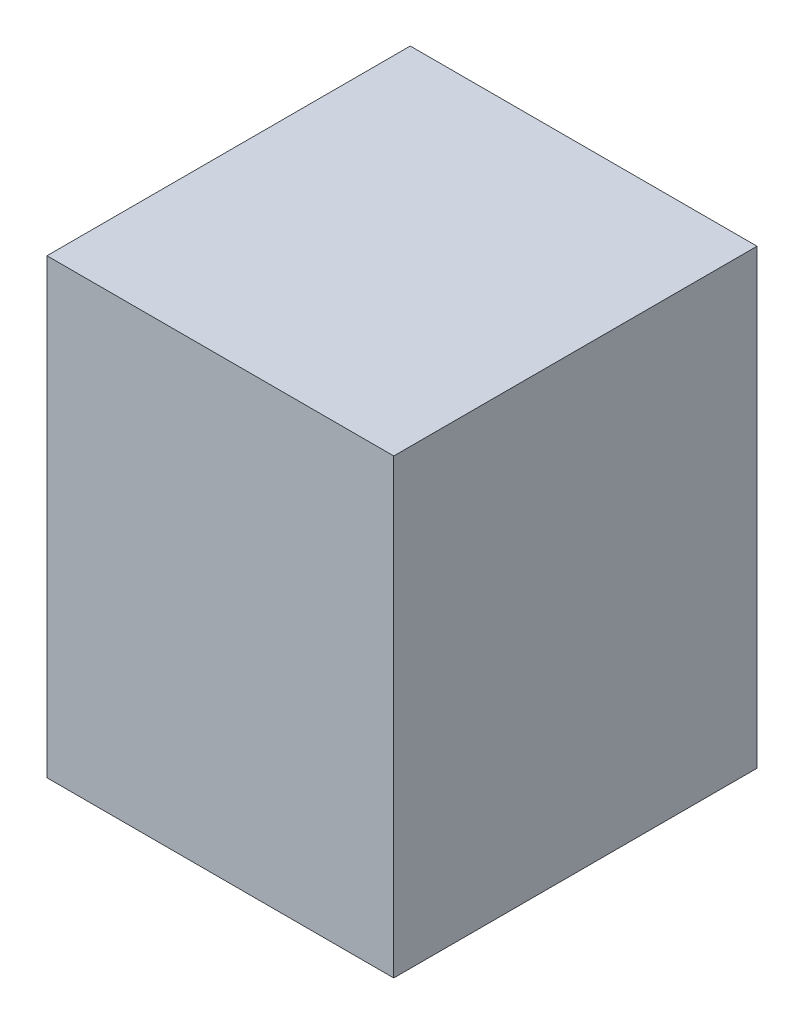
ISO-10303-21;
HEADER;
FILE_DESCRIPTION(('STEP AP214'),'2;1');
FILE_NAME('part.step','',(''),(''),'','','');
FILE_SCHEMA(('AUTOMOTIVE_DESIGN { 1 0 10303 214 1 1 1 1 }'));
ENDSEC;
DATA;
#1=APPLICATION_CONTEXT('core data for automotive mechanical design processes');
#2=APPLICATION_PROTOCOL_DEFINITION('international standard','automotive_design',2000,#1);
#3=PRODUCT_CONTEXT('',#1,'mechanical');
#4=PRODUCT('Part','Part','',(#3));
#5=PRODUCT_RELATED_PRODUCT_CATEGORY('part','',(#4));
#6=PRODUCT_DEFINITION_FORMATION('','',#4);
#7=PRODUCT_DEFINITION_CONTEXT('part definition',#1,'design');
#8=PRODUCT_DEFINITION('design','',#6,#7);
#9=PRODUCT_DEFINITION_SHAPE('','',#8);
#10=(LENGTH_UNIT() NAMED_UNIT(*) SI_UNIT(.MILLI.,.METRE.));
#11=(NAMED_UNIT(*) PLANE_ANGLE_UNIT() SI_UNIT($,.RADIAN.));
#12=(NAMED_UNIT(*) SI_UNIT($,.STERADIAN.) SOLID_ANGLE_UNIT());
#13=UNCERTAINTY_MEASURE_WITH_UNIT(LENGTH_MEASURE(1.E-05),#10,'distance_accuracy_value','');
#14=(GEOMETRIC_REPRESENTATION_CONTEXT(3) GLOBAL_UNCERTAINTY_ASSIGNED_CONTEXT((#13)) GLOBAL_UNIT_ASSIGNED_CONTEXT((#10,
#11,#12)) REPRESENTATION_CONTEXT('',''));
#15=CARTESIAN_POINT('',(0.,0.,0.));
#16=DIRECTION('',(0.,0.,1.));
#17=DIRECTION('',(1.,0.,0.));
#18=AXIS2_PLACEMENT_3D('',#15,#16,#17);
#19=CARTESIAN_POINT('',(0.,0.,0.));
#20=DIRECTION('',(0.,0.,-1.));
#21=DIRECTION('',(-1.,0.,0.));
#22=AXIS2_PLACEMENT_3D('',#19,#20,#21);
#23=PLANE('',#22);
#24=DIRECTION('',(0.,-1.,0.));
#25=VECTOR('',#24,1.);
#26=CARTESIAN_POINT('',(-10.,-10.,0.));
#27=LINE('',#26,#25);
#28=CARTESIAN_POINT('',(-10.,562.45,0.));
#29=VERTEX_POINT('',#28);
#30=CARTESIAN_POINT('',(-10.,-10.,0.));
#31=VERTEX_POINT('',#30);
#32=EDGE_CURVE('E156',#29,#31,#27,.T.);
#33=ORIENTED_EDGE('',*,*,#32,.F.);
#34=DIRECTION('',(-1.,0.,0.));
#35=VECTOR('',#34,1.);
#36=CARTESIAN_POINT('',(-10.,562.45,0.));
#37=LINE('',#36,#35);
#38=CARTESIAN_POINT('',(429.1,562.45,0.));
#39=VERTEX_POINT('',#38);
#40=EDGE_CURVE('E56',#39,#29,#37,.T.);
#41=ORIENTED_EDGE('',*,*,#40,.F.);
#42=DIRECTION('',(0.,1.,0.));
#43=VECTOR('',#42,1.);
#44=CARTESIAN_POINT('',(429.1,-10.,0.));
#45=LINE('',#44,#43);
#46=CARTESIAN_POINT('',(429.1,-10.,0.));
#47=VERTEX_POINT('',#46);
#48=EDGE_CURVE('E107',#47,#39,#45,.T.);
#49=ORIENTED_EDGE('',*,*,#48,.F.);
#50=DIRECTION('',(1.,0.,0.));
#51=VECTOR('',#50,1.);
#52=CARTESIAN_POINT('',(-10.,-10.,0.));
#53=LINE('',#52,#51);
#54=EDGE_CURVE('E159',#31,#47,#53,.T.);
#55=ORIENTED_EDGE('',*,*,#54,.F.);
#56=EDGE_LOOP('',(#33,#41,#49,#55));
#57=FACE_BOUND('',#56,.T.);
#58=DIRECTION('',(1.,0.,0.));
#59=VECTOR('',#58,1.);
#60=CARTESIAN_POINT('',(419.1,0.,0.));
#61=LINE('',#60,#59);
#62=CARTESIAN_POINT('',(0.,0.,0.));
#63=VERTEX_POINT('',#62);
#64=CARTESIAN_POINT('',(419.1,0.,0.));
#65=VERTEX_POINT('',#64);
#66=EDGE_CURVE('E130',#63,#65,#61,.T.);
#67=ORIENTED_EDGE('',*,*,#66,.T.);
#68=DIRECTION('',(0.,1.,0.));
#69=VECTOR('',#68,1.);
#70=CARTESIAN_POINT('',(419.1,552.45,0.));
#71=LINE('',#70,#69);
#72=CARTESIAN_POINT('',(419.1,552.45,0.));
#73=VERTEX_POINT('',#72);
#74=EDGE_CURVE('E48',#65,#73,#71,.T.);
#75=ORIENTED_EDGE('',*,*,#74,.T.);
#76=DIRECTION('',(-1.,0.,0.));
#77=VECTOR('',#76,1.);
#78=CARTESIAN_POINT('',(419.1,552.45,0.));
#79=LINE('',#78,#77);
#80=CARTESIAN_POINT('',(0.,552.45,0.));
#81=VERTEX_POINT('',#80);
#82=EDGE_CURVE('E141',#73,#81,#79,.T.);
#83=ORIENTED_EDGE('',*,*,#82,.T.);
#84=DIRECTION('',(0.,-1.,0.));
#85=VECTOR('',#84,1.);
#86=CARTESIAN_POINT('',(0.,552.45,0.));
#87=LINE('',#86,#85);
#88=EDGE_CURVE('E144',#81,#63,#87,.T.);
#89=ORIENTED_EDGE('',*,*,#88,.T.);
#90=EDGE_LOOP('',(#67,#75,#83,#89));
#91=FACE_BOUND('',#90,.T.);
#92=ADVANCED_FACE('F33',(#57,#91),#23,.T.);
#93=CARTESIAN_POINT('',(-10.,-10.,450.));
#94=DIRECTION('',(1.,0.,0.));
#95=DIRECTION('',(0.,0.,-1.));
#96=AXIS2_PLACEMENT_3D('',#93,#94,#95);
#97=PLANE('',#96);
#98=ORIENTED_EDGE('',*,*,#32,.T.);
#99=DIRECTION('',(0.,0.,-1.));
#100=VECTOR('',#99,1.);
#101=CARTESIAN_POINT('',(-10.,-10.,450.));
#102=LINE('',#101,#100);
#103=CARTESIAN_POINT('',(-10.,-10.,460.));
#104=VERTEX_POINT('',#103);
#105=EDGE_CURVE('E11',#104,#31,#102,.T.);
#106=ORIENTED_EDGE('',*,*,#105,.F.);
#107=DIRECTION('',(0.,-1.,0.));
#108=VECTOR('',#107,1.);
#109=CARTESIAN_POINT('',(-10.,562.45,460.));
#110=LINE('',#109,#108);
#111=CARTESIAN_POINT('',(-10.,562.45,460.));
#112=VERTEX_POINT('',#111);
#113=EDGE_CURVE('E116',#112,#104,#110,.T.);
#114=ORIENTED_EDGE('',*,*,#113,.F.);
#115=DIRECTION('',(0.,0.,-1.));
#116=VECTOR('',#115,1.);
#117=CARTESIAN_POINT('',(-10.,562.45,450.));
#118=LINE('',#117,#116);
#119=EDGE_CURVE('E108',#112,#29,#118,.T.);
#120=ORIENTED_EDGE('',*,*,#119,.T.);
#121=EDGE_LOOP('',(#98,#106,#114,#120));
#122=FACE_BOUND('',#121,.T.);
#123=ADVANCED_FACE('F35',(#122),#97,.F.);
#124=CARTESIAN_POINT('',(-10.,-10.,450.));
#125=DIRECTION('',(0.,1.,0.));
#126=DIRECTION('',(0.,0.,1.));
#127=AXIS2_PLACEMENT_3D('',#124,#125,#126);
#128=PLANE('',#127);
#129=ORIENTED_EDGE('',*,*,#54,.T.);
#130=DIRECTION('',(0.,0.,-1.));
#131=VECTOR('',#130,1.);
#132=CARTESIAN_POINT('',(429.1,-10.,450.));
#133=LINE('',#132,#131);
#134=CARTESIAN_POINT('',(429.1,-10.,460.));
#135=VERTEX_POINT('',#134);
#136=EDGE_CURVE('E41',#135,#47,#133,.T.);
#137=ORIENTED_EDGE('',*,*,#136,.F.);
#138=DIRECTION('',(1.,0.,0.));
#139=VECTOR('',#138,1.);
#140=CARTESIAN_POINT('',(429.1,-10.,460.));
#141=LINE('',#140,#139);
#142=EDGE_CURVE('E121',#104,#135,#141,.T.);
#143=ORIENTED_EDGE('',*,*,#142,.F.);
#144=ORIENTED_EDGE('',*,*,#105,.T.);
#145=EDGE_LOOP('',(#129,#137,#143,#144));
#146=FACE_BOUND('',#145,.T.);
#147=ADVANCED_FACE('F168',(#146),#128,.F.);
#148=CARTESIAN_POINT('',(429.1,-10.,450.));
#149=DIRECTION('',(-1.,0.,0.));
#150=DIRECTION('',(0.,0.,1.));
#151=AXIS2_PLACEMENT_3D('',#148,#149,#150);
#152=PLANE('',#151);
#153=ORIENTED_EDGE('',*,*,#48,.T.);
#154=DIRECTION('',(0.,0.,-1.));
#155=VECTOR('',#154,1.);
#156=CARTESIAN_POINT('',(429.1,562.45,450.));
#157=LINE('',#156,#155);
#158=CARTESIAN_POINT('',(429.1,562.45,460.));
#159=VERTEX_POINT('',#158);
#160=EDGE_CURVE('E100',#159,#39,#157,.T.);
#161=ORIENTED_EDGE('',*,*,#160,.F.);
#162=DIRECTION('',(0.,1.,0.));
#163=VECTOR('',#162,1.);
#164=CARTESIAN_POINT('',(429.1,562.45,460.));
#165=LINE('',#164,#163);
#166=EDGE_CURVE('E105',#135,#159,#165,.T.);
#167=ORIENTED_EDGE('',*,*,#166,.F.);
#168=ORIENTED_EDGE('',*,*,#136,.T.);
#169=EDGE_LOOP('',(#153,#161,#167,#168));
#170=FACE_BOUND('',#169,.T.);
#171=ADVANCED_FACE('F102',(#170),#152,.F.);
#172=CARTESIAN_POINT('',(-10.,562.45,450.));
#173=DIRECTION('',(0.,-1.,0.));
#174=DIRECTION('',(0.,0.,-1.));
#175=AXIS2_PLACEMENT_3D('',#172,#173,#174);
#176=PLANE('',#175);
#177=ORIENTED_EDGE('',*,*,#40,.T.);
#178=ORIENTED_EDGE('',*,*,#119,.F.);
#179=DIRECTION('',(-1.,0.,0.));
#180=VECTOR('',#179,1.);
#181=CARTESIAN_POINT('',(429.1,562.45,460.));
#182=LINE('',#181,#180);
#183=EDGE_CURVE('E111',#159,#112,#182,.T.);
#184=ORIENTED_EDGE('',*,*,#183,.F.);
#185=ORIENTED_EDGE('',*,*,#160,.T.);
#186=EDGE_LOOP('',(#177,#178,#184,#185));
#187=FACE_BOUND('',#186,.T.);
#188=ADVANCED_FACE('F112',(#187),#176,.F.);
#189=CARTESIAN_POINT('',(419.1,552.45,450.));
#190=DIRECTION('',(-1.,0.,0.));
#191=DIRECTION('',(0.,0.,1.));
#192=AXIS2_PLACEMENT_3D('',#189,#190,#191);
#193=PLANE('',#192);
#194=ORIENTED_EDGE('',*,*,#74,.F.);
#195=DIRECTION('',(0.,0.,-1.));
#196=VECTOR('',#195,1.);
#197=CARTESIAN_POINT('',(419.1,0.,450.));
#198=LINE('',#197,#196);
#199=CARTESIAN_POINT('',(419.1,0.,450.));
#200=VERTEX_POINT('',#199);
#201=EDGE_CURVE('E139',#200,#65,#198,.T.);
#202=ORIENTED_EDGE('',*,*,#201,.F.);
#203=DIRECTION('',(0.,1.,0.));
#204=VECTOR('',#203,1.);
#205=CARTESIAN_POINT('',(419.1,552.45,450.));
#206=LINE('',#205,#204);
#207=CARTESIAN_POINT('',(419.1,552.45,450.));
#208=VERTEX_POINT('',#207);
#209=EDGE_CURVE('E126',#200,#208,#206,.T.);
#210=ORIENTED_EDGE('',*,*,#209,.T.);
#211=DIRECTION('',(0.,0.,-1.));
#212=VECTOR('',#211,1.);
#213=CARTESIAN_POINT('',(419.1,552.45,450.));
#214=LINE('',#213,#212);
#215=EDGE_CURVE('E154',#208,#73,#214,.T.);
#216=ORIENTED_EDGE('',*,*,#215,.T.);
#217=EDGE_LOOP('',(#194,#202,#210,#216));
#218=FACE_BOUND('',#217,.T.);
#219=ADVANCED_FACE('F181',(#218),#193,.T.);
#220=CARTESIAN_POINT('',(419.1,552.45,450.));
#221=DIRECTION('',(0.,-1.,0.));
#222=DIRECTION('',(0.,0.,-1.));
#223=AXIS2_PLACEMENT_3D('',#220,#221,#222);
#224=PLANE('',#223);
#225=ORIENTED_EDGE('',*,*,#82,.F.);
#226=ORIENTED_EDGE('',*,*,#215,.F.);
#227=DIRECTION('',(-1.,0.,0.));
#228=VECTOR('',#227,1.);
#229=CARTESIAN_POINT('',(419.1,552.45,450.));
#230=LINE('',#229,#228);
#231=CARTESIAN_POINT('',(0.,552.45,450.));
#232=VERTEX_POINT('',#231);
#233=EDGE_CURVE('E129',#208,#232,#230,.T.);
#234=ORIENTED_EDGE('',*,*,#233,.T.);
#235=DIRECTION('',(0.,0.,-1.));
#236=VECTOR('',#235,1.);
#237=CARTESIAN_POINT('',(0.,552.45,450.));
#238=LINE('',#237,#236);
#239=EDGE_CURVE('E152',#232,#81,#238,.T.);
#240=ORIENTED_EDGE('',*,*,#239,.T.);
#241=EDGE_LOOP('',(#225,#226,#234,#240));
#242=FACE_BOUND('',#241,.T.);
#243=ADVANCED_FACE('F187',(#242),#224,.T.);
#244=CARTESIAN_POINT('',(0.,552.45,450.));
#245=DIRECTION('',(1.,0.,0.));
#246=DIRECTION('',(0.,0.,-1.));
#247=AXIS2_PLACEMENT_3D('',#244,#245,#246);
#248=PLANE('',#247);
#249=ORIENTED_EDGE('',*,*,#88,.F.);
#250=ORIENTED_EDGE('',*,*,#239,.F.);
#251=DIRECTION('',(0.,-1.,0.));
#252=VECTOR('',#251,1.);
#253=CARTESIAN_POINT('',(0.,552.45,450.));
#254=LINE('',#253,#252);
#255=CARTESIAN_POINT('',(0.,0.,450.));
#256=VERTEX_POINT('',#255);
#257=EDGE_CURVE('E133',#232,#256,#254,.T.);
#258=ORIENTED_EDGE('',*,*,#257,.T.);
#259=DIRECTION('',(0.,0.,-1.));
#260=VECTOR('',#259,1.);
#261=CARTESIAN_POINT('',(0.,0.,450.));
#262=LINE('',#261,#260);
#263=EDGE_CURVE('E150',#256,#63,#262,.T.);
#264=ORIENTED_EDGE('',*,*,#263,.T.);
#265=EDGE_LOOP('',(#249,#250,#258,#264));
#266=FACE_BOUND('',#265,.T.);
#267=ADVANCED_FACE('F191',(#266),#248,.T.);
#268=CARTESIAN_POINT('',(419.1,0.,450.));
#269=DIRECTION('',(0.,1.,0.));
#270=DIRECTION('',(0.,0.,1.));
#271=AXIS2_PLACEMENT_3D('',#268,#269,#270);
#272=PLANE('',#271);
#273=ORIENTED_EDGE('',*,*,#66,.F.);
#274=ORIENTED_EDGE('',*,*,#263,.F.);
#275=DIRECTION('',(1.,0.,0.));
#276=VECTOR('',#275,1.);
#277=CARTESIAN_POINT('',(419.1,0.,450.));
#278=LINE('',#277,#276);
#279=EDGE_CURVE('E136',#256,#200,#278,.T.);
#280=ORIENTED_EDGE('',*,*,#279,.T.);
#281=ORIENTED_EDGE('',*,*,#201,.T.);
#282=EDGE_LOOP('',(#273,#274,#280,#281));
#283=FACE_BOUND('',#282,.T.);
#284=ADVANCED_FACE('F196',(#283),#272,.T.);
#285=CARTESIAN_POINT('',(0.,0.,450.));
#286=DIRECTION('',(0.,0.,-1.));
#287=DIRECTION('',(-1.,0.,0.));
#288=AXIS2_PLACEMENT_3D('',#285,#286,#287);
#289=PLANE('',#288);
#290=ORIENTED_EDGE('',*,*,#233,.F.);
#291=ORIENTED_EDGE('',*,*,#209,.F.);
#292=ORIENTED_EDGE('',*,*,#279,.F.);
#293=ORIENTED_EDGE('',*,*,#257,.F.);
#294=EDGE_LOOP('',(#290,#291,#292,#293));
#295=FACE_BOUND('',#294,.T.);
#296=ADVANCED_FACE('F202',(#295),#289,.T.);
#297=CARTESIAN_POINT('',(0.,0.,460.));
#298=DIRECTION('',(0.,0.,-1.));
#299=DIRECTION('',(-1.,0.,0.));
#300=AXIS2_PLACEMENT_3D('',#297,#298,#299);
#301=PLANE('',#300);
#302=ORIENTED_EDGE('',*,*,#166,.T.);
#303=ORIENTED_EDGE('',*,*,#183,.T.);
#304=ORIENTED_EDGE('',*,*,#113,.T.);
#305=ORIENTED_EDGE('',*,*,#142,.T.);
#306=EDGE_LOOP('',(#302,#303,#304,#305));
#307=FACE_BOUND('',#306,.T.);
#308=ADVANCED_FACE('F119',(#307),#301,.F.);
#309=CLOSED_SHELL('',(#92,#123,#147,#171,#188,#219,#243,#267,#284,#296,#308));
#310=MANIFOLD_SOLID_BREP('B2',#309);
#311=ADVANCED_BREP_SHAPE_REPRESENTATION('',(#18,#310),#14);
#312=SHAPE_DEFINITION_REPRESENTATION(#9,#311);
ENDSEC;
END-ISO-10303-21;
